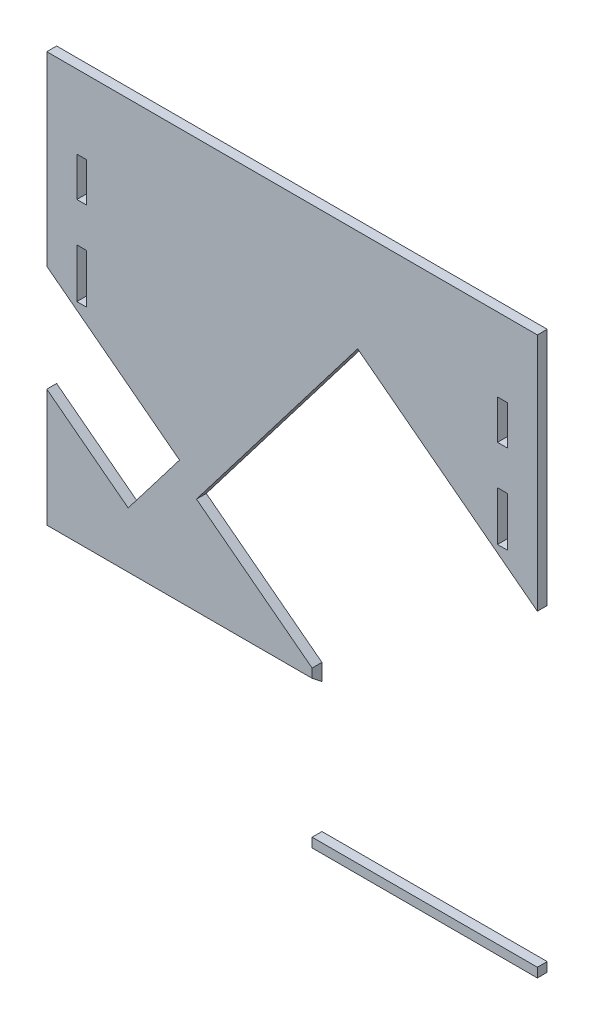
ISO-10303-21;
HEADER;
FILE_DESCRIPTION(('STEP AP214'),'2;1');
FILE_NAME('part.step','',(''),(''),'','','');
FILE_SCHEMA(('AUTOMOTIVE_DESIGN { 1 0 10303 214 1 1 1 1 }'));
ENDSEC;
DATA;
#1=APPLICATION_CONTEXT('core data for automotive mechanical design processes');
#2=APPLICATION_PROTOCOL_DEFINITION('international standard','automotive_design',2000,#1);
#3=PRODUCT_CONTEXT('',#1,'mechanical');
#4=PRODUCT('Part','Part','',(#3));
#5=PRODUCT_RELATED_PRODUCT_CATEGORY('part','',(#4));
#6=PRODUCT_DEFINITION_FORMATION('','',#4);
#7=PRODUCT_DEFINITION_CONTEXT('part definition',#1,'design');
#8=PRODUCT_DEFINITION('design','',#6,#7);
#9=PRODUCT_DEFINITION_SHAPE('','',#8);
#10=(LENGTH_UNIT() NAMED_UNIT(*) SI_UNIT(.MILLI.,.METRE.));
#11=(NAMED_UNIT(*) PLANE_ANGLE_UNIT() SI_UNIT($,.RADIAN.));
#12=(NAMED_UNIT(*) SI_UNIT($,.STERADIAN.) SOLID_ANGLE_UNIT());
#13=UNCERTAINTY_MEASURE_WITH_UNIT(LENGTH_MEASURE(1.E-05),#10,'distance_accuracy_value','');
#14=(GEOMETRIC_REPRESENTATION_CONTEXT(3) GLOBAL_UNCERTAINTY_ASSIGNED_CONTEXT((#13)) GLOBAL_UNIT_ASSIGNED_CONTEXT((#10,
#11,#12)) REPRESENTATION_CONTEXT('',''));
#15=CARTESIAN_POINT('',(0.,0.,0.));
#16=DIRECTION('',(0.,0.,1.));
#17=DIRECTION('',(1.,0.,0.));
#18=AXIS2_PLACEMENT_3D('',#15,#16,#17);
#19=CARTESIAN_POINT('',(0.,0.,5.));
#20=DIRECTION('',(1.,0.,0.));
#21=DIRECTION('',(0.,1.,0.));
#22=AXIS2_PLACEMENT_3D('',#19,#20,#21);
#23=PLANE('',#22);
#24=DIRECTION('',(0.,-1.,0.));
#25=VECTOR('',#24,1.);
#26=CARTESIAN_POINT('',(0.,0.,0.));
#27=LINE('',#26,#25);
#28=CARTESIAN_POINT('',(0.,0.,0.));
#29=VERTEX_POINT('',#28);
#30=CARTESIAN_POINT('',(0.,-94.5646580558317,0.));
#31=VERTEX_POINT('',#30);
#32=EDGE_CURVE('E402',#29,#31,#27,.T.);
#33=ORIENTED_EDGE('',*,*,#32,.T.);
#34=DIRECTION('',(0.,0.,1.));
#35=VECTOR('',#34,1.);
#36=CARTESIAN_POINT('',(0.,-94.5646580558317,0.));
#37=LINE('',#36,#35);
#38=CARTESIAN_POINT('',(0.,-94.5646580558317,5.));
#39=VERTEX_POINT('',#38);
#40=EDGE_CURVE('E380',#31,#39,#37,.T.);
#41=ORIENTED_EDGE('',*,*,#40,.T.);
#42=DIRECTION('',(0.,-1.,0.));
#43=VECTOR('',#42,1.);
#44=CARTESIAN_POINT('',(0.,0.,5.));
#45=LINE('',#44,#43);
#46=CARTESIAN_POINT('',(0.,0.,5.));
#47=VERTEX_POINT('',#46);
#48=EDGE_CURVE('E409',#47,#39,#45,.T.);
#49=ORIENTED_EDGE('',*,*,#48,.F.);
#50=DIRECTION('',(0.,0.,-1.));
#51=VECTOR('',#50,1.);
#52=CARTESIAN_POINT('',(0.,0.,5.));
#53=LINE('',#52,#51);
#54=EDGE_CURVE('E396',#47,#29,#53,.T.);
#55=ORIENTED_EDGE('',*,*,#54,.T.);
#56=EDGE_LOOP('',(#33,#41,#49,#55));
#57=FACE_BOUND('',#56,.T.);
#58=ADVANCED_FACE('F43',(#57),#23,.F.);
#59=CARTESIAN_POINT('',(249.6,0.,5.));
#60=DIRECTION('',(-1.,0.,0.));
#61=DIRECTION('',(0.,-1.,0.));
#62=AXIS2_PLACEMENT_3D('',#59,#60,#61);
#63=PLANE('',#62);
#64=DIRECTION('',(0.,1.,0.));
#65=VECTOR('',#64,1.);
#66=CARTESIAN_POINT('',(249.6,0.,5.));
#67=LINE('',#66,#65);
#68=CARTESIAN_POINT('',(249.6,-121.767183305226,5.));
#69=VERTEX_POINT('',#68);
#70=CARTESIAN_POINT('',(249.6,0.,5.));
#71=VERTEX_POINT('',#70);
#72=EDGE_CURVE('E408',#69,#71,#67,.T.);
#73=ORIENTED_EDGE('',*,*,#72,.F.);
#74=DIRECTION('',(0.,0.,1.));
#75=VECTOR('',#74,1.);
#76=CARTESIAN_POINT('',(249.6,-121.767183305226,0.));
#77=LINE('',#76,#75);
#78=CARTESIAN_POINT('',(249.6,-121.767183305226,0.));
#79=VERTEX_POINT('',#78);
#80=EDGE_CURVE('E51',#79,#69,#77,.T.);
#81=ORIENTED_EDGE('',*,*,#80,.F.);
#82=DIRECTION('',(0.,1.,0.));
#83=VECTOR('',#82,1.);
#84=CARTESIAN_POINT('',(249.6,0.,0.));
#85=LINE('',#84,#83);
#86=CARTESIAN_POINT('',(249.6,0.,0.));
#87=VERTEX_POINT('',#86);
#88=EDGE_CURVE('E383',#79,#87,#85,.T.);
#89=ORIENTED_EDGE('',*,*,#88,.T.);
#90=DIRECTION('',(0.,0.,-1.));
#91=VECTOR('',#90,1.);
#92=CARTESIAN_POINT('',(249.6,0.,5.));
#93=LINE('',#92,#91);
#94=EDGE_CURVE('E392',#71,#87,#93,.T.);
#95=ORIENTED_EDGE('',*,*,#94,.F.);
#96=EDGE_LOOP('',(#73,#81,#89,#95));
#97=FACE_BOUND('',#96,.T.);
#98=ADVANCED_FACE('F45',(#97),#63,.F.);
#99=CARTESIAN_POINT('',(0.,0.,5.));
#100=DIRECTION('',(0.,0.,1.));
#101=DIRECTION('',(1.,0.,0.));
#102=AXIS2_PLACEMENT_3D('',#99,#100,#101);
#103=PLANE('',#102);
#104=DIRECTION('',(0.,-1.,0.));
#105=VECTOR('',#104,1.);
#106=CARTESIAN_POINT('',(15.2881556161835,-77.4778714858661,5.));
#107=LINE('',#106,#105);
#108=CARTESIAN_POINT('',(15.2881556161835,-77.4778714858661,5.));
#109=VERTEX_POINT('',#108);
#110=CARTESIAN_POINT('',(15.2881556161835,-102.477871485866,5.));
#111=VERTEX_POINT('',#110);
#112=EDGE_CURVE('E58',#109,#111,#107,.T.);
#113=ORIENTED_EDGE('',*,*,#112,.F.);
#114=DIRECTION('',(-1.,0.,0.));
#115=VECTOR('',#114,1.);
#116=CARTESIAN_POINT('',(15.2881556161835,-77.4778714858661,5.));
#117=LINE('',#116,#115);
#118=CARTESIAN_POINT('',(20.2881556161835,-77.4778714858661,5.));
#119=VERTEX_POINT('',#118);
#120=EDGE_CURVE('E307',#119,#109,#117,.T.);
#121=ORIENTED_EDGE('',*,*,#120,.F.);
#122=DIRECTION('',(0.,1.,0.));
#123=VECTOR('',#122,1.);
#124=CARTESIAN_POINT('',(20.2881556161835,-77.4778714858661,5.));
#125=LINE('',#124,#123);
#126=CARTESIAN_POINT('',(20.2881556161835,-102.477871485866,5.));
#127=VERTEX_POINT('',#126);
#128=EDGE_CURVE('E321',#127,#119,#125,.T.);
#129=ORIENTED_EDGE('',*,*,#128,.F.);
#130=DIRECTION('',(1.,0.,0.));
#131=VECTOR('',#130,1.);
#132=CARTESIAN_POINT('',(15.2881556161835,-102.477871485866,5.));
#133=LINE('',#132,#131);
#134=EDGE_CURVE('E318',#111,#127,#133,.T.);
#135=ORIENTED_EDGE('',*,*,#134,.F.);
#136=EDGE_LOOP('',(#113,#121,#129,#135));
#137=FACE_BOUND('',#136,.T.);
#138=DIRECTION('',(0.,-1.,0.));
#139=VECTOR('',#138,1.);
#140=CARTESIAN_POINT('',(229.311844383817,-77.4778714858661,5.));
#141=LINE('',#140,#139);
#142=CARTESIAN_POINT('',(229.311844383817,-77.4778714858661,5.));
#143=VERTEX_POINT('',#142);
#144=CARTESIAN_POINT('',(229.311844383817,-102.477871485866,5.));
#145=VERTEX_POINT('',#144);
#146=EDGE_CURVE('E66',#143,#145,#141,.T.);
#147=ORIENTED_EDGE('',*,*,#146,.F.);
#148=DIRECTION('',(-1.,0.,0.));
#149=VECTOR('',#148,1.);
#150=CARTESIAN_POINT('',(229.311844383817,-77.4778714858661,5.));
#151=LINE('',#150,#149);
#152=CARTESIAN_POINT('',(234.311844383817,-77.4778714858661,5.));
#153=VERTEX_POINT('',#152);
#154=EDGE_CURVE('E277',#153,#143,#151,.T.);
#155=ORIENTED_EDGE('',*,*,#154,.F.);
#156=DIRECTION('',(0.,1.,0.));
#157=VECTOR('',#156,1.);
#158=CARTESIAN_POINT('',(234.311844383817,-77.4778714858661,5.));
#159=LINE('',#158,#157);
#160=CARTESIAN_POINT('',(234.311844383817,-102.477871485866,5.));
#161=VERTEX_POINT('',#160);
#162=EDGE_CURVE('E292',#161,#153,#159,.T.);
#163=ORIENTED_EDGE('',*,*,#162,.F.);
#164=DIRECTION('',(1.,0.,0.));
#165=VECTOR('',#164,1.);
#166=CARTESIAN_POINT('',(229.311844383817,-102.477871485866,5.));
#167=LINE('',#166,#165);
#168=EDGE_CURVE('E288',#145,#161,#167,.T.);
#169=ORIENTED_EDGE('',*,*,#168,.F.);
#170=EDGE_LOOP('',(#147,#155,#163,#169));
#171=FACE_BOUND('',#170,.T.);
#172=DIRECTION('',(0.,-1.,0.));
#173=VECTOR('',#172,1.);
#174=CARTESIAN_POINT('',(229.311844383817,-37.4778714858661,5.));
#175=LINE('',#174,#173);
#176=CARTESIAN_POINT('',(229.311844383817,-37.4778714858661,5.));
#177=VERTEX_POINT('',#176);
#178=CARTESIAN_POINT('',(229.311844383817,-57.4778714858661,5.));
#179=VERTEX_POINT('',#178);
#180=EDGE_CURVE('E235',#177,#179,#175,.T.);
#181=ORIENTED_EDGE('',*,*,#180,.F.);
#182=DIRECTION('',(-1.,0.,0.));
#183=VECTOR('',#182,1.);
#184=CARTESIAN_POINT('',(229.311844383817,-37.4778714858661,5.));
#185=LINE('',#184,#183);
#186=CARTESIAN_POINT('',(234.311844383817,-37.4778714858661,5.));
#187=VERTEX_POINT('',#186);
#188=EDGE_CURVE('E253',#187,#177,#185,.T.);
#189=ORIENTED_EDGE('',*,*,#188,.F.);
#190=DIRECTION('',(0.,1.,0.));
#191=VECTOR('',#190,1.);
#192=CARTESIAN_POINT('',(234.311844383817,-37.4778714858661,5.));
#193=LINE('',#192,#191);
#194=CARTESIAN_POINT('',(234.311844383817,-57.4778714858661,5.));
#195=VERTEX_POINT('',#194);
#196=EDGE_CURVE('E256',#195,#187,#193,.T.);
#197=ORIENTED_EDGE('',*,*,#196,.F.);
#198=DIRECTION('',(1.,0.,0.));
#199=VECTOR('',#198,1.);
#200=CARTESIAN_POINT('',(229.311844383817,-57.4778714858661,5.));
#201=LINE('',#200,#199);
#202=EDGE_CURVE('E262',#179,#195,#201,.T.);
#203=ORIENTED_EDGE('',*,*,#202,.F.);
#204=EDGE_LOOP('',(#181,#189,#197,#203));
#205=FACE_BOUND('',#204,.T.);
#206=DIRECTION('',(0.,-1.,0.));
#207=VECTOR('',#206,1.);
#208=CARTESIAN_POINT('',(15.2881556161835,-37.4778714858661,5.));
#209=LINE('',#208,#207);
#210=CARTESIAN_POINT('',(15.2881556161835,-37.4778714858661,5.));
#211=VERTEX_POINT('',#210);
#212=CARTESIAN_POINT('',(15.2881556161835,-57.4778714858661,5.));
#213=VERTEX_POINT('',#212);
#214=EDGE_CURVE('E269',#211,#213,#209,.T.);
#215=ORIENTED_EDGE('',*,*,#214,.F.);
#216=DIRECTION('',(-1.,0.,0.));
#217=VECTOR('',#216,1.);
#218=CARTESIAN_POINT('',(15.2881556161835,-37.4778714858661,5.));
#219=LINE('',#218,#217);
#220=CARTESIAN_POINT('',(20.2881556161835,-37.4778714858661,5.));
#221=VERTEX_POINT('',#220);
#222=EDGE_CURVE('E336',#221,#211,#219,.T.);
#223=ORIENTED_EDGE('',*,*,#222,.F.);
#224=DIRECTION('',(0.,1.,0.));
#225=VECTOR('',#224,1.);
#226=CARTESIAN_POINT('',(20.2881556161835,-37.4778714858661,5.));
#227=LINE('',#226,#225);
#228=CARTESIAN_POINT('',(20.2881556161835,-57.4778714858661,5.));
#229=VERTEX_POINT('',#228);
#230=EDGE_CURVE('E350',#229,#221,#227,.T.);
#231=ORIENTED_EDGE('',*,*,#230,.F.);
#232=DIRECTION('',(1.,0.,0.));
#233=VECTOR('',#232,1.);
#234=CARTESIAN_POINT('',(15.2881556161835,-57.4778714858661,5.));
#235=LINE('',#234,#233);
#236=EDGE_CURVE('E347',#213,#229,#235,.T.);
#237=ORIENTED_EDGE('',*,*,#236,.F.);
#238=EDGE_LOOP('',(#215,#223,#231,#237));
#239=FACE_BOUND('',#238,.T.);
#240=DIRECTION('',(-0.794388962001185,0.607409398223867,0.));
#241=VECTOR('',#240,1.);
#242=CARTESIAN_POINT('',(0.,-94.5646580558317,5.));
#243=LINE('',#242,#241);
#244=CARTESIAN_POINT('',(67.5230617701007,-146.19445690486,5.));
#245=VERTEX_POINT('',#244);
#246=EDGE_CURVE('E368',#245,#39,#243,.T.);
#247=ORIENTED_EDGE('',*,*,#246,.F.);
#248=DIRECTION('',(0.607409398223867,0.794388962001185,0.));
#249=VECTOR('',#248,1.);
#250=CARTESIAN_POINT('',(67.5230617701007,-146.19445690486,5.));
#251=LINE('',#250,#249);
#252=CARTESIAN_POINT('',(41.4044576464744,-180.353182270911,5.));
#253=VERTEX_POINT('',#252);
#254=EDGE_CURVE('E376',#253,#245,#251,.T.);
#255=ORIENTED_EDGE('',*,*,#254,.F.);
#256=DIRECTION('',(0.794388962001185,-0.607409398223867,0.));
#257=VECTOR('',#256,1.);
#258=CARTESIAN_POINT('',(-26.1186041236263,-128.723383421883,5.));
#259=LINE('',#258,#257);
#260=CARTESIAN_POINT('',(0.,-148.694312490703,5.));
#261=VERTEX_POINT('',#260);
#262=EDGE_CURVE('E357',#261,#253,#259,.T.);
#263=ORIENTED_EDGE('',*,*,#262,.F.);
#264=CARTESIAN_POINT('',(1.32380998121945E-13,-208.618578951241,4.99999999999998));
#265=VERTEX_POINT('',#264);
#266=EDGE_CURVE('E407',#261,#265,#45,.T.);
#267=ORIENTED_EDGE('',*,*,#266,.T.);
#268=DIRECTION('',(1.,0.,0.));
#269=VECTOR('',#268,1.);
#270=CARTESIAN_POINT('',(0.,-208.618578951241,5.));
#271=LINE('',#270,#269);
#272=CARTESIAN_POINT('',(135.000000000001,-208.618578951241,4.99999999999998));
#273=VERTEX_POINT('',#272);
#274=EDGE_CURVE('E412',#265,#273,#271,.T.);
#275=ORIENTED_EDGE('',*,*,#274,.T.);
#276=DIRECTION('',(0.,-1.,0.));
#277=VECTOR('',#276,1.);
#278=CARTESIAN_POINT('',(135.000000000001,-204.083134421686,5.));
#279=LINE('',#278,#277);
#280=CARTESIAN_POINT('',(135.000000000001,-204.083134421686,5.));
#281=VERTEX_POINT('',#280);
#282=EDGE_CURVE('E430',#281,#273,#279,.T.);
#283=ORIENTED_EDGE('',*,*,#282,.F.);
#284=DIRECTION('',(0.794388962001186,-0.607409398223866,0.));
#285=VECTOR('',#284,1.);
#286=CARTESIAN_POINT('',(135.000000000001,-204.083134421686,5.));
#287=LINE('',#286,#285);
#288=CARTESIAN_POINT('',(76.149175744963,-159.084342324072,5.));
#289=VERTEX_POINT('',#288);
#290=EDGE_CURVE('E428',#289,#281,#287,.T.);
#291=ORIENTED_EDGE('',*,*,#290,.F.);
#292=DIRECTION('',(-0.607409398223868,-0.794388962001184,0.));
#293=VECTOR('',#292,1.);
#294=CARTESIAN_POINT('',(76.149175744963,-159.084342324072,5.));
#295=LINE('',#294,#293);
#296=CARTESIAN_POINT('',(158.149444505186,-51.841832453912,5.));
#297=VERTEX_POINT('',#296);
#298=EDGE_CURVE('E425',#297,#289,#295,.T.);
#299=ORIENTED_EDGE('',*,*,#298,.F.);
#300=DIRECTION('',(-0.794388962001203,0.607409398223843,0.));
#301=VECTOR('',#300,1.);
#302=CARTESIAN_POINT('',(158.149444505186,-51.841832453912,5.));
#303=LINE('',#302,#301);
#304=EDGE_CURVE('E422',#69,#297,#303,.T.);
#305=ORIENTED_EDGE('',*,*,#304,.F.);
#306=ORIENTED_EDGE('',*,*,#72,.T.);
#307=DIRECTION('',(-1.,0.,0.));
#308=VECTOR('',#307,1.);
#309=CARTESIAN_POINT('',(0.,0.,5.));
#310=LINE('',#309,#308);
#311=EDGE_CURVE('E405',#71,#47,#310,.T.);
#312=ORIENTED_EDGE('',*,*,#311,.T.);
#313=ORIENTED_EDGE('',*,*,#48,.T.);
#314=EDGE_LOOP('',(#247,#255,#263,#267,#275,#283,#291,#299,#305,#306,#312,#313));
#315=FACE_BOUND('',#314,.T.);
#316=ADVANCED_FACE('F465',(#137,#171,#205,#239,#315),#103,.T.);
#317=CARTESIAN_POINT('',(0.,0.,0.));
#318=DIRECTION('',(0.,0.,1.));
#319=DIRECTION('',(1.,0.,0.));
#320=AXIS2_PLACEMENT_3D('',#317,#318,#319);
#321=PLANE('',#320);
#322=DIRECTION('',(-1.,0.,0.));
#323=VECTOR('',#322,1.);
#324=CARTESIAN_POINT('',(15.2881556161835,-77.4778714858661,0.));
#325=LINE('',#324,#323);
#326=CARTESIAN_POINT('',(20.2881556161835,-77.4778714858661,0.));
#327=VERTEX_POINT('',#326);
#328=CARTESIAN_POINT('',(15.2881556161835,-77.4778714858661,0.));
#329=VERTEX_POINT('',#328);
#330=EDGE_CURVE('E313',#327,#329,#325,.T.);
#331=ORIENTED_EDGE('',*,*,#330,.T.);
#332=DIRECTION('',(0.,-1.,0.));
#333=VECTOR('',#332,1.);
#334=CARTESIAN_POINT('',(15.2881556161835,-77.4778714858661,0.));
#335=LINE('',#334,#333);
#336=CARTESIAN_POINT('',(15.2881556161835,-102.477871485866,0.));
#337=VERTEX_POINT('',#336);
#338=EDGE_CURVE('E303',#329,#337,#335,.T.);
#339=ORIENTED_EDGE('',*,*,#338,.T.);
#340=DIRECTION('',(1.,0.,0.));
#341=VECTOR('',#340,1.);
#342=CARTESIAN_POINT('',(15.2881556161835,-102.477871485866,0.));
#343=LINE('',#342,#341);
#344=CARTESIAN_POINT('',(20.2881556161835,-102.477871485866,0.));
#345=VERTEX_POINT('',#344);
#346=EDGE_CURVE('E306',#337,#345,#343,.T.);
#347=ORIENTED_EDGE('',*,*,#346,.T.);
#348=DIRECTION('',(0.,1.,0.));
#349=VECTOR('',#348,1.);
#350=CARTESIAN_POINT('',(20.2881556161835,-77.4778714858661,0.));
#351=LINE('',#350,#349);
#352=EDGE_CURVE('E310',#345,#327,#351,.T.);
#353=ORIENTED_EDGE('',*,*,#352,.T.);
#354=EDGE_LOOP('',(#331,#339,#347,#353));
#355=FACE_BOUND('',#354,.T.);
#356=DIRECTION('',(-1.,0.,0.));
#357=VECTOR('',#356,1.);
#358=CARTESIAN_POINT('',(229.311844383817,-77.4778714858661,0.));
#359=LINE('',#358,#357);
#360=CARTESIAN_POINT('',(234.311844383817,-77.4778714858661,0.));
#361=VERTEX_POINT('',#360);
#362=CARTESIAN_POINT('',(229.311844383817,-77.4778714858661,0.));
#363=VERTEX_POINT('',#362);
#364=EDGE_CURVE('E283',#361,#363,#359,.T.);
#365=ORIENTED_EDGE('',*,*,#364,.T.);
#366=DIRECTION('',(0.,-1.,0.));
#367=VECTOR('',#366,1.);
#368=CARTESIAN_POINT('',(229.311844383817,-77.4778714858661,0.));
#369=LINE('',#368,#367);
#370=CARTESIAN_POINT('',(229.311844383817,-102.477871485866,0.));
#371=VERTEX_POINT('',#370);
#372=EDGE_CURVE('E273',#363,#371,#369,.T.);
#373=ORIENTED_EDGE('',*,*,#372,.T.);
#374=DIRECTION('',(1.,0.,0.));
#375=VECTOR('',#374,1.);
#376=CARTESIAN_POINT('',(229.311844383817,-102.477871485866,0.));
#377=LINE('',#376,#375);
#378=CARTESIAN_POINT('',(234.311844383817,-102.477871485866,0.));
#379=VERTEX_POINT('',#378);
#380=EDGE_CURVE('E276',#371,#379,#377,.T.);
#381=ORIENTED_EDGE('',*,*,#380,.T.);
#382=DIRECTION('',(0.,1.,0.));
#383=VECTOR('',#382,1.);
#384=CARTESIAN_POINT('',(234.311844383817,-77.4778714858661,0.));
#385=LINE('',#384,#383);
#386=EDGE_CURVE('E280',#379,#361,#385,.T.);
#387=ORIENTED_EDGE('',*,*,#386,.T.);
#388=EDGE_LOOP('',(#365,#373,#381,#387));
#389=FACE_BOUND('',#388,.T.);
#390=DIRECTION('',(-1.,0.,0.));
#391=VECTOR('',#390,1.);
#392=CARTESIAN_POINT('',(229.311844383817,-37.4778714858661,0.));
#393=LINE('',#392,#391);
#394=CARTESIAN_POINT('',(234.311844383817,-37.4778714858661,0.));
#395=VERTEX_POINT('',#394);
#396=CARTESIAN_POINT('',(229.311844383817,-37.4778714858661,0.));
#397=VERTEX_POINT('',#396);
#398=EDGE_CURVE('E240',#395,#397,#393,.T.);
#399=ORIENTED_EDGE('',*,*,#398,.T.);
#400=DIRECTION('',(0.,-1.,0.));
#401=VECTOR('',#400,1.);
#402=CARTESIAN_POINT('',(229.311844383817,-37.4778714858661,0.));
#403=LINE('',#402,#401);
#404=CARTESIAN_POINT('',(229.311844383817,-57.4778714858661,0.));
#405=VERTEX_POINT('',#404);
#406=EDGE_CURVE('E232',#397,#405,#403,.T.);
#407=ORIENTED_EDGE('',*,*,#406,.T.);
#408=DIRECTION('',(1.,0.,0.));
#409=VECTOR('',#408,1.);
#410=CARTESIAN_POINT('',(229.311844383817,-57.4778714858661,0.));
#411=LINE('',#410,#409);
#412=CARTESIAN_POINT('',(234.311844383817,-57.4778714858661,0.));
#413=VERTEX_POINT('',#412);
#414=EDGE_CURVE('E244',#405,#413,#411,.T.);
#415=ORIENTED_EDGE('',*,*,#414,.T.);
#416=DIRECTION('',(0.,1.,0.));
#417=VECTOR('',#416,1.);
#418=CARTESIAN_POINT('',(234.311844383817,-37.4778714858661,0.));
#419=LINE('',#418,#417);
#420=EDGE_CURVE('E248',#413,#395,#419,.T.);
#421=ORIENTED_EDGE('',*,*,#420,.T.);
#422=EDGE_LOOP('',(#399,#407,#415,#421));
#423=FACE_BOUND('',#422,.T.);
#424=DIRECTION('',(-1.,0.,0.));
#425=VECTOR('',#424,1.);
#426=CARTESIAN_POINT('',(15.2881556161835,-37.4778714858661,0.));
#427=LINE('',#426,#425);
#428=CARTESIAN_POINT('',(20.2881556161835,-37.4778714858661,0.));
#429=VERTEX_POINT('',#428);
#430=CARTESIAN_POINT('',(15.2881556161835,-37.4778714858661,0.));
#431=VERTEX_POINT('',#430);
#432=EDGE_CURVE('E342',#429,#431,#427,.T.);
#433=ORIENTED_EDGE('',*,*,#432,.T.);
#434=DIRECTION('',(0.,-1.,0.));
#435=VECTOR('',#434,1.);
#436=CARTESIAN_POINT('',(15.2881556161835,-37.4778714858661,0.));
#437=LINE('',#436,#435);
#438=CARTESIAN_POINT('',(15.2881556161835,-57.4778714858661,0.));
#439=VERTEX_POINT('',#438);
#440=EDGE_CURVE('E332',#431,#439,#437,.T.);
#441=ORIENTED_EDGE('',*,*,#440,.T.);
#442=DIRECTION('',(1.,0.,0.));
#443=VECTOR('',#442,1.);
#444=CARTESIAN_POINT('',(15.2881556161835,-57.4778714858661,0.));
#445=LINE('',#444,#443);
#446=CARTESIAN_POINT('',(20.2881556161835,-57.4778714858661,0.));
#447=VERTEX_POINT('',#446);
#448=EDGE_CURVE('E335',#439,#447,#445,.T.);
#449=ORIENTED_EDGE('',*,*,#448,.T.);
#450=DIRECTION('',(0.,1.,0.));
#451=VECTOR('',#450,1.);
#452=CARTESIAN_POINT('',(20.2881556161835,-37.4778714858661,0.));
#453=LINE('',#452,#451);
#454=EDGE_CURVE('E339',#447,#429,#453,.T.);
#455=ORIENTED_EDGE('',*,*,#454,.T.);
#456=EDGE_LOOP('',(#433,#441,#449,#455));
#457=FACE_BOUND('',#456,.T.);
#458=DIRECTION('',(0.607409398223867,0.794388962001185,0.));
#459=VECTOR('',#458,1.);
#460=CARTESIAN_POINT('',(67.5230617701007,-146.19445690486,0.));
#461=LINE('',#460,#459);
#462=CARTESIAN_POINT('',(41.4044576464744,-180.353182270911,0.));
#463=VERTEX_POINT('',#462);
#464=CARTESIAN_POINT('',(67.5230617701007,-146.19445690486,0.));
#465=VERTEX_POINT('',#464);
#466=EDGE_CURVE('E367',#463,#465,#461,.T.);
#467=ORIENTED_EDGE('',*,*,#466,.T.);
#468=DIRECTION('',(-0.794388962001185,0.607409398223867,0.));
#469=VECTOR('',#468,1.);
#470=CARTESIAN_POINT('',(0.,-94.5646580558317,0.));
#471=LINE('',#470,#469);
#472=EDGE_CURVE('E371',#465,#31,#471,.T.);
#473=ORIENTED_EDGE('',*,*,#472,.T.);
#474=ORIENTED_EDGE('',*,*,#32,.F.);
#475=DIRECTION('',(-1.,0.,0.));
#476=VECTOR('',#475,1.);
#477=CARTESIAN_POINT('',(0.,0.,0.));
#478=LINE('',#477,#476);
#479=EDGE_CURVE('E395',#87,#29,#478,.T.);
#480=ORIENTED_EDGE('',*,*,#479,.F.);
#481=ORIENTED_EDGE('',*,*,#88,.F.);
#482=DIRECTION('',(-0.794388962001154,0.607409398223908,0.));
#483=VECTOR('',#482,1.);
#484=CARTESIAN_POINT('',(214.957001473172,-95.2782919756631,0.));
#485=LINE('',#484,#483);
#486=CARTESIAN_POINT('',(158.149444505186,-51.841832453912,0.));
#487=VERTEX_POINT('',#486);
#488=EDGE_CURVE('E443',#79,#487,#485,.T.);
#489=ORIENTED_EDGE('',*,*,#488,.T.);
#490=DIRECTION('',(-0.607409398223868,-0.794388962001184,0.));
#491=VECTOR('',#490,1.);
#492=CARTESIAN_POINT('',(76.149175744963,-159.084342324072,0.));
#493=LINE('',#492,#491);
#494=CARTESIAN_POINT('',(76.149175744963,-159.084342324072,0.));
#495=VERTEX_POINT('',#494);
#496=EDGE_CURVE('E418',#487,#495,#493,.T.);
#497=ORIENTED_EDGE('',*,*,#496,.T.);
#498=DIRECTION('',(0.794388962001186,-0.607409398223866,0.));
#499=VECTOR('',#498,1.);
#500=CARTESIAN_POINT('',(135.000000000001,-204.083134421686,0.));
#501=LINE('',#500,#499);
#502=CARTESIAN_POINT('',(135.000000000001,-204.083134421686,0.));
#503=VERTEX_POINT('',#502);
#504=EDGE_CURVE('E415',#495,#503,#501,.T.);
#505=ORIENTED_EDGE('',*,*,#504,.T.);
#506=DIRECTION('',(0.,-1.,0.));
#507=VECTOR('',#506,1.);
#508=CARTESIAN_POINT('',(135.000000000001,-204.083134421686,0.));
#509=LINE('',#508,#507);
#510=CARTESIAN_POINT('',(135.000000000001,-212.525007083775,0.));
#511=VERTEX_POINT('',#510);
#512=EDGE_CURVE('E440',#503,#511,#509,.T.);
#513=ORIENTED_EDGE('',*,*,#512,.T.);
#514=DIRECTION('',(1.,0.,0.));
#515=VECTOR('',#514,1.);
#516=CARTESIAN_POINT('',(0.,-212.525007083775,0.));
#517=LINE('',#516,#515);
#518=CARTESIAN_POINT('',(0.,-212.525007083775,0.));
#519=VERTEX_POINT('',#518);
#520=EDGE_CURVE('E388',#519,#511,#517,.T.);
#521=ORIENTED_EDGE('',*,*,#520,.F.);
#522=CARTESIAN_POINT('',(0.,-148.694312490703,0.));
#523=VERTEX_POINT('',#522);
#524=EDGE_CURVE('E399',#523,#519,#27,.T.);
#525=ORIENTED_EDGE('',*,*,#524,.F.);
#526=DIRECTION('',(0.794388962001185,-0.607409398223867,0.));
#527=VECTOR('',#526,1.);
#528=CARTESIAN_POINT('',(-26.1186041236263,-128.723383421883,0.));
#529=LINE('',#528,#527);
#530=EDGE_CURVE('E364',#523,#463,#529,.T.);
#531=ORIENTED_EDGE('',*,*,#530,.T.);
#532=EDGE_LOOP('',(#467,#473,#474,#480,#481,#489,#497,#505,#513,#521,#525,#531));
#533=FACE_BOUND('',#532,.T.);
#534=ADVANCED_FACE('F250',(#355,#389,#423,#457,#533),#321,.F.);
#535=ORIENTED_EDGE('',*,*,#266,.F.);
#536=DIRECTION('',(0.,0.,-1.));
#537=VECTOR('',#536,1.);
#538=CARTESIAN_POINT('',(0.,-148.694312490703,5.));
#539=LINE('',#538,#537);
#540=EDGE_CURVE('E12',#261,#523,#539,.T.);
#541=ORIENTED_EDGE('',*,*,#540,.T.);
#542=ORIENTED_EDGE('',*,*,#524,.T.);
#543=DIRECTION('',(0.,0.61566147532566,0.788010753606721));
#544=VECTOR('',#543,1.);
#545=CARTESIAN_POINT('',(1.21955812873337E-13,-266.558641082654,-69.1598976938488));
#546=LINE('',#545,#544);
#547=EDGE_CURVE('E400',#519,#265,#546,.T.);
#548=ORIENTED_EDGE('',*,*,#547,.T.);
#549=EDGE_LOOP('',(#535,#541,#542,#548));
#550=FACE_BOUND('',#549,.T.);
#551=ADVANCED_FACE('F491',(#550),#23,.F.);
#552=CARTESIAN_POINT('',(0.,0.,5.));
#553=DIRECTION('',(0.,-1.,0.));
#554=DIRECTION('',(1.,0.,0.));
#555=AXIS2_PLACEMENT_3D('',#552,#553,#554);
#556=PLANE('',#555);
#557=ORIENTED_EDGE('',*,*,#479,.T.);
#558=ORIENTED_EDGE('',*,*,#54,.F.);
#559=ORIENTED_EDGE('',*,*,#311,.F.);
#560=ORIENTED_EDGE('',*,*,#94,.T.);
#561=EDGE_LOOP('',(#557,#558,#559,#560));
#562=FACE_BOUND('',#561,.T.);
#563=ADVANCED_FACE('F457',(#562),#556,.F.);
#564=CARTESIAN_POINT('',(0.,-131.969729829907,103.106053050081));
#565=DIRECTION('',(0.,-0.788010753606721,0.61566147532566));
#566=DIRECTION('',(0.,-0.61566147532566,-0.788010753606721));
#567=AXIS2_PLACEMENT_3D('',#564,#565,#566);
#568=PLANE('',#567);
#569=ORIENTED_EDGE('',*,*,#547,.F.);
#570=ORIENTED_EDGE('',*,*,#520,.T.);
#571=DIRECTION('',(0.,-0.61566147532566,-0.788010753606721));
#572=VECTOR('',#571,1.);
#573=CARTESIAN_POINT('',(135.000000000001,-266.558641082654,-69.1598976938488));
#574=LINE('',#573,#572);
#575=EDGE_CURVE('E391',#273,#511,#574,.T.);
#576=ORIENTED_EDGE('',*,*,#575,.F.);
#577=ORIENTED_EDGE('',*,*,#274,.F.);
#578=EDGE_LOOP('',(#569,#570,#576,#577));
#579=FACE_BOUND('',#578,.T.);
#580=ADVANCED_FACE('F487',(#579),#568,.T.);
#581=CARTESIAN_POINT('',(135.000000000001,-204.083134421686,0.));
#582=DIRECTION('',(-1.,0.,0.));
#583=DIRECTION('',(0.,0.,1.));
#584=AXIS2_PLACEMENT_3D('',#581,#582,#583);
#585=PLANE('',#584);
#586=ORIENTED_EDGE('',*,*,#575,.T.);
#587=ORIENTED_EDGE('',*,*,#512,.F.);
#588=DIRECTION('',(0.,0.,1.));
#589=VECTOR('',#588,1.);
#590=CARTESIAN_POINT('',(135.000000000001,-204.083134421686,0.));
#591=LINE('',#590,#589);
#592=EDGE_CURVE('E420',#503,#281,#591,.T.);
#593=ORIENTED_EDGE('',*,*,#592,.T.);
#594=ORIENTED_EDGE('',*,*,#282,.T.);
#595=EDGE_LOOP('',(#586,#587,#593,#594));
#596=FACE_BOUND('',#595,.T.);
#597=ADVANCED_FACE('F481',(#596),#585,.F.);
#598=CARTESIAN_POINT('',(135.000000000001,-204.083134421686,0.));
#599=DIRECTION('',(-0.607409398223866,-0.794388962001186,0.));
#600=DIRECTION('',(0.794388962001186,-0.607409398223866,0.));
#601=AXIS2_PLACEMENT_3D('',#598,#599,#600);
#602=PLANE('',#601);
#603=ORIENTED_EDGE('',*,*,#290,.T.);
#604=ORIENTED_EDGE('',*,*,#592,.F.);
#605=ORIENTED_EDGE('',*,*,#504,.F.);
#606=DIRECTION('',(0.,0.,1.));
#607=VECTOR('',#606,1.);
#608=CARTESIAN_POINT('',(76.149175744963,-159.084342324072,0.));
#609=LINE('',#608,#607);
#610=EDGE_CURVE('E426',#495,#289,#609,.T.);
#611=ORIENTED_EDGE('',*,*,#610,.T.);
#612=EDGE_LOOP('',(#603,#604,#605,#611));
#613=FACE_BOUND('',#612,.T.);
#614=ADVANCED_FACE('F477',(#613),#602,.F.);
#615=CARTESIAN_POINT('',(76.149175744963,-159.084342324072,0.));
#616=DIRECTION('',(-0.794388962001184,0.607409398223868,0.));
#617=DIRECTION('',(-0.607409398223868,-0.794388962001184,0.));
#618=AXIS2_PLACEMENT_3D('',#615,#616,#617);
#619=PLANE('',#618);
#620=ORIENTED_EDGE('',*,*,#298,.T.);
#621=ORIENTED_EDGE('',*,*,#610,.F.);
#622=ORIENTED_EDGE('',*,*,#496,.F.);
#623=DIRECTION('',(0.,0.,1.));
#624=VECTOR('',#623,1.);
#625=CARTESIAN_POINT('',(158.149444505186,-51.841832453912,0.));
#626=LINE('',#625,#624);
#627=EDGE_CURVE('E423',#487,#297,#626,.T.);
#628=ORIENTED_EDGE('',*,*,#627,.T.);
#629=EDGE_LOOP('',(#620,#621,#622,#628));
#630=FACE_BOUND('',#629,.T.);
#631=ADVANCED_FACE('F475',(#630),#619,.F.);
#632=CARTESIAN_POINT('',(158.149444505186,-51.841832453912,0.));
#633=DIRECTION('',(0.607409398223843,0.794388962001203,0.));
#634=DIRECTION('',(-0.794388962001203,0.607409398223843,0.));
#635=AXIS2_PLACEMENT_3D('',#632,#633,#634);
#636=PLANE('',#635);
#637=ORIENTED_EDGE('',*,*,#304,.T.);
#638=ORIENTED_EDGE('',*,*,#627,.F.);
#639=ORIENTED_EDGE('',*,*,#488,.F.);
#640=ORIENTED_EDGE('',*,*,#80,.T.);
#641=EDGE_LOOP('',(#637,#638,#639,#640));
#642=FACE_BOUND('',#641,.T.);
#643=ADVANCED_FACE('F471',(#642),#636,.F.);
#644=CARTESIAN_POINT('',(-26.1186041236263,-128.723383421883,0.));
#645=DIRECTION('',(-0.607409398223867,-0.794388962001185,0.));
#646=DIRECTION('',(0.794388962001185,-0.607409398223867,0.));
#647=AXIS2_PLACEMENT_3D('',#644,#645,#646);
#648=PLANE('',#647);
#649=ORIENTED_EDGE('',*,*,#262,.T.);
#650=DIRECTION('',(0.,0.,1.));
#651=VECTOR('',#650,1.);
#652=CARTESIAN_POINT('',(41.4044576464744,-180.353182270911,0.));
#653=LINE('',#652,#651);
#654=EDGE_CURVE('E374',#463,#253,#653,.T.);
#655=ORIENTED_EDGE('',*,*,#654,.F.);
#656=ORIENTED_EDGE('',*,*,#530,.F.);
#657=ORIENTED_EDGE('',*,*,#540,.F.);
#658=EDGE_LOOP('',(#649,#655,#656,#657));
#659=FACE_BOUND('',#658,.T.);
#660=ADVANCED_FACE('F494',(#659),#648,.F.);
#661=CARTESIAN_POINT('',(0.,-94.5646580558317,0.));
#662=DIRECTION('',(0.607409398223867,0.794388962001185,0.));
#663=DIRECTION('',(-0.794388962001185,0.607409398223867,0.));
#664=AXIS2_PLACEMENT_3D('',#661,#662,#663);
#665=PLANE('',#664);
#666=ORIENTED_EDGE('',*,*,#246,.T.);
#667=ORIENTED_EDGE('',*,*,#40,.F.);
#668=ORIENTED_EDGE('',*,*,#472,.F.);
#669=DIRECTION('',(0.,0.,1.));
#670=VECTOR('',#669,1.);
#671=CARTESIAN_POINT('',(67.5230617701007,-146.19445690486,0.));
#672=LINE('',#671,#670);
#673=EDGE_CURVE('E384',#465,#245,#672,.T.);
#674=ORIENTED_EDGE('',*,*,#673,.T.);
#675=EDGE_LOOP('',(#666,#667,#668,#674));
#676=FACE_BOUND('',#675,.T.);
#677=ADVANCED_FACE('F499',(#676),#665,.F.);
#678=CARTESIAN_POINT('',(67.5230617701007,-146.19445690486,0.));
#679=DIRECTION('',(0.794388962001185,-0.607409398223867,0.));
#680=DIRECTION('',(0.607409398223867,0.794388962001185,0.));
#681=AXIS2_PLACEMENT_3D('',#678,#679,#680);
#682=PLANE('',#681);
#683=ORIENTED_EDGE('',*,*,#254,.T.);
#684=ORIENTED_EDGE('',*,*,#673,.F.);
#685=ORIENTED_EDGE('',*,*,#466,.F.);
#686=ORIENTED_EDGE('',*,*,#654,.T.);
#687=EDGE_LOOP('',(#683,#684,#685,#686));
#688=FACE_BOUND('',#687,.T.);
#689=ADVANCED_FACE('F497',(#688),#682,.F.);
#690=CARTESIAN_POINT('',(15.2881556161835,-37.4778714858661,0.));
#691=DIRECTION('',(-1.,0.,0.));
#692=DIRECTION('',(0.,-1.,0.));
#693=AXIS2_PLACEMENT_3D('',#690,#691,#692);
#694=PLANE('',#693);
#695=ORIENTED_EDGE('',*,*,#214,.T.);
#696=DIRECTION('',(0.,0.,1.));
#697=VECTOR('',#696,1.);
#698=CARTESIAN_POINT('',(15.2881556161835,-57.4778714858661,0.));
#699=LINE('',#698,#697);
#700=EDGE_CURVE('E345',#439,#213,#699,.T.);
#701=ORIENTED_EDGE('',*,*,#700,.F.);
#702=ORIENTED_EDGE('',*,*,#440,.F.);
#703=DIRECTION('',(0.,0.,1.));
#704=VECTOR('',#703,1.);
#705=CARTESIAN_POINT('',(15.2881556161835,-37.4778714858661,0.));
#706=LINE('',#705,#704);
#707=EDGE_CURVE('E355',#431,#211,#706,.T.);
#708=ORIENTED_EDGE('',*,*,#707,.T.);
#709=EDGE_LOOP('',(#695,#701,#702,#708));
#710=FACE_BOUND('',#709,.T.);
#711=ADVANCED_FACE('F506',(#710),#694,.F.);
#712=CARTESIAN_POINT('',(15.2881556161835,-37.4778714858661,0.));
#713=DIRECTION('',(0.,1.,0.));
#714=DIRECTION('',(0.,0.,1.));
#715=AXIS2_PLACEMENT_3D('',#712,#713,#714);
#716=PLANE('',#715);
#717=ORIENTED_EDGE('',*,*,#222,.T.);
#718=ORIENTED_EDGE('',*,*,#707,.F.);
#719=ORIENTED_EDGE('',*,*,#432,.F.);
#720=DIRECTION('',(0.,0.,1.));
#721=VECTOR('',#720,1.);
#722=CARTESIAN_POINT('',(20.2881556161835,-37.4778714858661,0.));
#723=LINE('',#722,#721);
#724=EDGE_CURVE('E358',#429,#221,#723,.T.);
#725=ORIENTED_EDGE('',*,*,#724,.T.);
#726=EDGE_LOOP('',(#717,#718,#719,#725));
#727=FACE_BOUND('',#726,.T.);
#728=ADVANCED_FACE('F595',(#727),#716,.F.);
#729=CARTESIAN_POINT('',(20.2881556161835,-37.4778714858661,0.));
#730=DIRECTION('',(1.,0.,0.));
#731=DIRECTION('',(0.,0.,-1.));
#732=AXIS2_PLACEMENT_3D('',#729,#730,#731);
#733=PLANE('',#732);
#734=ORIENTED_EDGE('',*,*,#230,.T.);
#735=ORIENTED_EDGE('',*,*,#724,.F.);
#736=ORIENTED_EDGE('',*,*,#454,.F.);
#737=DIRECTION('',(0.,0.,1.));
#738=VECTOR('',#737,1.);
#739=CARTESIAN_POINT('',(20.2881556161835,-57.4778714858661,0.));
#740=LINE('',#739,#738);
#741=EDGE_CURVE('E360',#447,#229,#740,.T.);
#742=ORIENTED_EDGE('',*,*,#741,.T.);
#743=EDGE_LOOP('',(#734,#735,#736,#742));
#744=FACE_BOUND('',#743,.T.);
#745=ADVANCED_FACE('F604',(#744),#733,.F.);
#746=CARTESIAN_POINT('',(15.2881556161835,-57.4778714858661,0.));
#747=DIRECTION('',(0.,-1.,0.));
#748=DIRECTION('',(0.,0.,-1.));
#749=AXIS2_PLACEMENT_3D('',#746,#747,#748);
#750=PLANE('',#749);
#751=ORIENTED_EDGE('',*,*,#236,.T.);
#752=ORIENTED_EDGE('',*,*,#741,.F.);
#753=ORIENTED_EDGE('',*,*,#448,.F.);
#754=ORIENTED_EDGE('',*,*,#700,.T.);
#755=EDGE_LOOP('',(#751,#752,#753,#754));
#756=FACE_BOUND('',#755,.T.);
#757=ADVANCED_FACE('F614',(#756),#750,.F.);
#758=CARTESIAN_POINT('',(229.311844383817,-37.4778714858661,0.));
#759=DIRECTION('',(-1.,0.,0.));
#760=DIRECTION('',(0.,0.,1.));
#761=AXIS2_PLACEMENT_3D('',#758,#759,#760);
#762=PLANE('',#761);
#763=ORIENTED_EDGE('',*,*,#180,.T.);
#764=DIRECTION('',(0.,0.,1.));
#765=VECTOR('',#764,1.);
#766=CARTESIAN_POINT('',(229.311844383817,-57.4778714858661,0.));
#767=LINE('',#766,#765);
#768=EDGE_CURVE('E228',#405,#179,#767,.T.);
#769=ORIENTED_EDGE('',*,*,#768,.F.);
#770=ORIENTED_EDGE('',*,*,#406,.F.);
#771=DIRECTION('',(0.,0.,1.));
#772=VECTOR('',#771,1.);
#773=CARTESIAN_POINT('',(229.311844383817,-37.4778714858661,0.));
#774=LINE('',#773,#772);
#775=EDGE_CURVE('E267',#397,#177,#774,.T.);
#776=ORIENTED_EDGE('',*,*,#775,.T.);
#777=EDGE_LOOP('',(#763,#769,#770,#776));
#778=FACE_BOUND('',#777,.T.);
#779=ADVANCED_FACE('F230',(#778),#762,.F.);
#780=CARTESIAN_POINT('',(229.311844383817,-37.4778714858661,0.));
#781=DIRECTION('',(0.,1.,0.));
#782=DIRECTION('',(0.,0.,1.));
#783=AXIS2_PLACEMENT_3D('',#780,#781,#782);
#784=PLANE('',#783);
#785=ORIENTED_EDGE('',*,*,#188,.T.);
#786=ORIENTED_EDGE('',*,*,#775,.F.);
#787=ORIENTED_EDGE('',*,*,#398,.F.);
#788=DIRECTION('',(0.,0.,1.));
#789=VECTOR('',#788,1.);
#790=CARTESIAN_POINT('',(234.311844383817,-37.4778714858661,0.));
#791=LINE('',#790,#789);
#792=EDGE_CURVE('E270',#395,#187,#791,.T.);
#793=ORIENTED_EDGE('',*,*,#792,.T.);
#794=EDGE_LOOP('',(#785,#786,#787,#793));
#795=FACE_BOUND('',#794,.T.);
#796=ADVANCED_FACE('F633',(#795),#784,.F.);
#797=CARTESIAN_POINT('',(234.311844383817,-37.4778714858661,0.));
#798=DIRECTION('',(1.,0.,0.));
#799=DIRECTION('',(0.,0.,-1.));
#800=AXIS2_PLACEMENT_3D('',#797,#798,#799);
#801=PLANE('',#800);
#802=ORIENTED_EDGE('',*,*,#196,.T.);
#803=ORIENTED_EDGE('',*,*,#792,.F.);
#804=ORIENTED_EDGE('',*,*,#420,.F.);
#805=DIRECTION('',(0.,0.,1.));
#806=VECTOR('',#805,1.);
#807=CARTESIAN_POINT('',(234.311844383817,-57.4778714858661,0.));
#808=LINE('',#807,#806);
#809=EDGE_CURVE('E239',#413,#195,#808,.T.);
#810=ORIENTED_EDGE('',*,*,#809,.T.);
#811=EDGE_LOOP('',(#802,#803,#804,#810));
#812=FACE_BOUND('',#811,.T.);
#813=ADVANCED_FACE('F642',(#812),#801,.F.);
#814=CARTESIAN_POINT('',(229.311844383817,-57.4778714858661,0.));
#815=DIRECTION('',(0.,-1.,0.));
#816=DIRECTION('',(0.,0.,-1.));
#817=AXIS2_PLACEMENT_3D('',#814,#815,#816);
#818=PLANE('',#817);
#819=ORIENTED_EDGE('',*,*,#202,.T.);
#820=ORIENTED_EDGE('',*,*,#809,.F.);
#821=ORIENTED_EDGE('',*,*,#414,.F.);
#822=ORIENTED_EDGE('',*,*,#768,.T.);
#823=EDGE_LOOP('',(#819,#820,#821,#822));
#824=FACE_BOUND('',#823,.T.);
#825=ADVANCED_FACE('F245',(#824),#818,.F.);
#826=CARTESIAN_POINT('',(229.311844383817,-77.4778714858661,0.));
#827=DIRECTION('',(-1.,0.,0.));
#828=DIRECTION('',(0.,0.,1.));
#829=AXIS2_PLACEMENT_3D('',#826,#827,#828);
#830=PLANE('',#829);
#831=ORIENTED_EDGE('',*,*,#146,.T.);
#832=DIRECTION('',(0.,0.,1.));
#833=VECTOR('',#832,1.);
#834=CARTESIAN_POINT('',(229.311844383817,-102.477871485866,0.));
#835=LINE('',#834,#833);
#836=EDGE_CURVE('E286',#371,#145,#835,.T.);
#837=ORIENTED_EDGE('',*,*,#836,.F.);
#838=ORIENTED_EDGE('',*,*,#372,.F.);
#839=DIRECTION('',(0.,0.,1.));
#840=VECTOR('',#839,1.);
#841=CARTESIAN_POINT('',(229.311844383817,-77.4778714858661,0.));
#842=LINE('',#841,#840);
#843=EDGE_CURVE('E263',#363,#143,#842,.T.);
#844=ORIENTED_EDGE('',*,*,#843,.T.);
#845=EDGE_LOOP('',(#831,#837,#838,#844));
#846=FACE_BOUND('',#845,.T.);
#847=ADVANCED_FACE('F661',(#846),#830,.F.);
#848=CARTESIAN_POINT('',(229.311844383817,-77.4778714858661,0.));
#849=DIRECTION('',(0.,1.,0.));
#850=DIRECTION('',(0.,0.,1.));
#851=AXIS2_PLACEMENT_3D('',#848,#849,#850);
#852=PLANE('',#851);
#853=ORIENTED_EDGE('',*,*,#154,.T.);
#854=ORIENTED_EDGE('',*,*,#843,.F.);
#855=ORIENTED_EDGE('',*,*,#364,.F.);
#856=DIRECTION('',(0.,0.,1.));
#857=VECTOR('',#856,1.);
#858=CARTESIAN_POINT('',(234.311844383817,-77.4778714858661,0.));
#859=LINE('',#858,#857);
#860=EDGE_CURVE('E298',#361,#153,#859,.T.);
#861=ORIENTED_EDGE('',*,*,#860,.T.);
#862=EDGE_LOOP('',(#853,#854,#855,#861));
#863=FACE_BOUND('',#862,.T.);
#864=ADVANCED_FACE('F670',(#863),#852,.F.);
#865=CARTESIAN_POINT('',(234.311844383817,-77.4778714858661,0.));
#866=DIRECTION('',(1.,0.,0.));
#867=DIRECTION('',(0.,0.,-1.));
#868=AXIS2_PLACEMENT_3D('',#865,#866,#867);
#869=PLANE('',#868);
#870=ORIENTED_EDGE('',*,*,#162,.T.);
#871=ORIENTED_EDGE('',*,*,#860,.F.);
#872=ORIENTED_EDGE('',*,*,#386,.F.);
#873=DIRECTION('',(0.,0.,1.));
#874=VECTOR('',#873,1.);
#875=CARTESIAN_POINT('',(234.311844383817,-102.477871485866,0.));
#876=LINE('',#875,#874);
#877=EDGE_CURVE('E300',#379,#161,#876,.T.);
#878=ORIENTED_EDGE('',*,*,#877,.T.);
#879=EDGE_LOOP('',(#870,#871,#872,#878));
#880=FACE_BOUND('',#879,.T.);
#881=ADVANCED_FACE('F679',(#880),#869,.F.);
#882=CARTESIAN_POINT('',(229.311844383817,-102.477871485866,0.));
#883=DIRECTION('',(0.,-1.,0.));
#884=DIRECTION('',(0.,0.,-1.));
#885=AXIS2_PLACEMENT_3D('',#882,#883,#884);
#886=PLANE('',#885);
#887=ORIENTED_EDGE('',*,*,#168,.T.);
#888=ORIENTED_EDGE('',*,*,#877,.F.);
#889=ORIENTED_EDGE('',*,*,#380,.F.);
#890=ORIENTED_EDGE('',*,*,#836,.T.);
#891=EDGE_LOOP('',(#887,#888,#889,#890));
#892=FACE_BOUND('',#891,.T.);
#893=ADVANCED_FACE('F689',(#892),#886,.F.);
#894=CARTESIAN_POINT('',(15.2881556161835,-77.4778714858661,0.));
#895=DIRECTION('',(-1.,0.,0.));
#896=DIRECTION('',(0.,0.,1.));
#897=AXIS2_PLACEMENT_3D('',#894,#895,#896);
#898=PLANE('',#897);
#899=ORIENTED_EDGE('',*,*,#112,.T.);
#900=DIRECTION('',(0.,0.,1.));
#901=VECTOR('',#900,1.);
#902=CARTESIAN_POINT('',(15.2881556161835,-102.477871485866,0.));
#903=LINE('',#902,#901);
#904=EDGE_CURVE('E316',#337,#111,#903,.T.);
#905=ORIENTED_EDGE('',*,*,#904,.F.);
#906=ORIENTED_EDGE('',*,*,#338,.F.);
#907=DIRECTION('',(0.,0.,1.));
#908=VECTOR('',#907,1.);
#909=CARTESIAN_POINT('',(15.2881556161835,-77.4778714858661,0.));
#910=LINE('',#909,#908);
#911=EDGE_CURVE('E289',#329,#109,#910,.T.);
#912=ORIENTED_EDGE('',*,*,#911,.T.);
#913=EDGE_LOOP('',(#899,#905,#906,#912));
#914=FACE_BOUND('',#913,.T.);
#915=ADVANCED_FACE('F699',(#914),#898,.F.);
#916=CARTESIAN_POINT('',(15.2881556161835,-77.4778714858661,0.));
#917=DIRECTION('',(0.,1.,0.));
#918=DIRECTION('',(0.,0.,1.));
#919=AXIS2_PLACEMENT_3D('',#916,#917,#918);
#920=PLANE('',#919);
#921=ORIENTED_EDGE('',*,*,#120,.T.);
#922=ORIENTED_EDGE('',*,*,#911,.F.);
#923=ORIENTED_EDGE('',*,*,#330,.F.);
#924=DIRECTION('',(0.,0.,1.));
#925=VECTOR('',#924,1.);
#926=CARTESIAN_POINT('',(20.2881556161835,-77.4778714858661,0.));
#927=LINE('',#926,#925);
#928=EDGE_CURVE('E327',#327,#119,#927,.T.);
#929=ORIENTED_EDGE('',*,*,#928,.T.);
#930=EDGE_LOOP('',(#921,#922,#923,#929));
#931=FACE_BOUND('',#930,.T.);
#932=ADVANCED_FACE('F709',(#931),#920,.F.);
#933=CARTESIAN_POINT('',(20.2881556161835,-77.4778714858661,0.));
#934=DIRECTION('',(1.,0.,0.));
#935=DIRECTION('',(0.,0.,-1.));
#936=AXIS2_PLACEMENT_3D('',#933,#934,#935);
#937=PLANE('',#936);
#938=ORIENTED_EDGE('',*,*,#128,.T.);
#939=ORIENTED_EDGE('',*,*,#928,.F.);
#940=ORIENTED_EDGE('',*,*,#352,.F.);
#941=DIRECTION('',(0.,0.,1.));
#942=VECTOR('',#941,1.);
#943=CARTESIAN_POINT('',(20.2881556161835,-102.477871485866,0.));
#944=LINE('',#943,#942);
#945=EDGE_CURVE('E329',#345,#127,#944,.T.);
#946=ORIENTED_EDGE('',*,*,#945,.T.);
#947=EDGE_LOOP('',(#938,#939,#940,#946));
#948=FACE_BOUND('',#947,.T.);
#949=ADVANCED_FACE('F718',(#948),#937,.F.);
#950=CARTESIAN_POINT('',(15.2881556161835,-102.477871485866,0.));
#951=DIRECTION('',(0.,-1.,0.));
#952=DIRECTION('',(0.,0.,-1.));
#953=AXIS2_PLACEMENT_3D('',#950,#951,#952);
#954=PLANE('',#953);
#955=ORIENTED_EDGE('',*,*,#134,.T.);
#956=ORIENTED_EDGE('',*,*,#945,.F.);
#957=ORIENTED_EDGE('',*,*,#346,.F.);
#958=ORIENTED_EDGE('',*,*,#904,.T.);
#959=EDGE_LOOP('',(#955,#956,#957,#958));
#960=FACE_BOUND('',#959,.T.);
#961=ADVANCED_FACE('F728',(#960),#954,.F.);
#962=CLOSED_SHELL('',(#58,#98,#316,#534,#551,#563,#580,#597,#614,#631,#643,#660,#677,#689,#711,
#728,#745,#757,#779,#796,#813,#825,#847,#864,#881,#893,#915,#932,#949,#961));
#963=MANIFOLD_SOLID_BREP('B2',#962);
#964=CARTESIAN_POINT('',(0.,-283.36,5.));
#965=DIRECTION('',(0.,1.,0.));
#966=DIRECTION('',(-1.,0.,0.));
#967=AXIS2_PLACEMENT_3D('',#964,#965,#966);
#968=PLANE('',#967);
#969=DIRECTION('',(1.,0.,0.));
#970=VECTOR('',#969,1.);
#971=CARTESIAN_POINT('',(0.,-283.36,5.));
#972=LINE('',#971,#970);
#973=CARTESIAN_POINT('',(135.000000000001,-283.36,5.));
#974=VERTEX_POINT('',#973);
#975=CARTESIAN_POINT('',(249.6,-283.36,5.));
#976=VERTEX_POINT('',#975);
#977=EDGE_CURVE('E822',#974,#976,#972,.T.);
#978=ORIENTED_EDGE('',*,*,#977,.F.);
#979=DIRECTION('',(0.,0.,-1.));
#980=VECTOR('',#979,1.);
#981=CARTESIAN_POINT('',(135.000000000001,-283.36,4.99999999999999));
#982=LINE('',#981,#980);
#983=CARTESIAN_POINT('',(135.000000000001,-283.36,0.));
#984=VERTEX_POINT('',#983);
#985=EDGE_CURVE('E846',#974,#984,#982,.T.);
#986=ORIENTED_EDGE('',*,*,#985,.T.);
#987=DIRECTION('',(1.,0.,0.));
#988=VECTOR('',#987,1.);
#989=CARTESIAN_POINT('',(0.,-283.36,0.));
#990=LINE('',#989,#988);
#991=CARTESIAN_POINT('',(249.6,-283.36,0.));
#992=VERTEX_POINT('',#991);
#993=EDGE_CURVE('E857',#984,#992,#990,.T.);
#994=ORIENTED_EDGE('',*,*,#993,.T.);
#995=DIRECTION('',(0.,0.,-1.));
#996=VECTOR('',#995,1.);
#997=CARTESIAN_POINT('',(249.6,-283.36,5.));
#998=LINE('',#997,#996);
#999=EDGE_CURVE('E806',#976,#992,#998,.T.);
#1000=ORIENTED_EDGE('',*,*,#999,.F.);
#1001=EDGE_LOOP('',(#978,#986,#994,#1000));
#1002=FACE_BOUND('',#1001,.T.);
#1003=ADVANCED_FACE('F799',(#1002),#968,.F.);
#1004=CARTESIAN_POINT('',(135.000000000001,-418.644716528751,49.6627670440035));
#1005=DIRECTION('',(1.,0.,0.));
#1006=DIRECTION('',(0.,1.,0.));
#1007=AXIS2_PLACEMENT_3D('',#1004,#1005,#1006);
#1008=PLANE('',#1007);
#1009=DIRECTION('',(0.,1.,0.));
#1010=VECTOR('',#1009,1.);
#1011=CARTESIAN_POINT('',(135.000000000001,0.,5.));
#1012=LINE('',#1011,#1010);
#1013=CARTESIAN_POINT('',(135.000000000001,-278.61211925782,5.));
#1014=VERTEX_POINT('',#1013);
#1015=EDGE_CURVE('E861',#974,#1014,#1012,.T.);
#1016=ORIENTED_EDGE('',*,*,#1015,.T.);
#1017=DIRECTION('',(0.,0.,1.));
#1018=VECTOR('',#1017,1.);
#1019=CARTESIAN_POINT('',(135.000000000001,-278.61211925782,0.));
#1020=LINE('',#1019,#1018);
#1021=CARTESIAN_POINT('',(135.000000000001,-278.61211925782,0.));
#1022=VERTEX_POINT('',#1021);
#1023=EDGE_CURVE('E847',#1022,#1014,#1020,.T.);
#1024=ORIENTED_EDGE('',*,*,#1023,.F.);
#1025=DIRECTION('',(0.,1.,0.));
#1026=VECTOR('',#1025,1.);
#1027=CARTESIAN_POINT('',(135.000000000001,0.,0.));
#1028=LINE('',#1027,#1026);
#1029=EDGE_CURVE('E41',#984,#1022,#1028,.T.);
#1030=ORIENTED_EDGE('',*,*,#1029,.F.);
#1031=ORIENTED_EDGE('',*,*,#985,.F.);
#1032=EDGE_LOOP('',(#1016,#1024,#1030,#1031));
#1033=FACE_BOUND('',#1032,.T.);
#1034=ADVANCED_FACE('F872',(#1033),#1008,.F.);
#1035=CARTESIAN_POINT('',(0.,0.,0.));
#1036=DIRECTION('',(0.,0.,1.));
#1037=DIRECTION('',(1.,0.,0.));
#1038=AXIS2_PLACEMENT_3D('',#1035,#1036,#1037);
#1039=PLANE('',#1038);
#1040=ORIENTED_EDGE('',*,*,#1029,.T.);
#1041=DIRECTION('',(1.,0.,0.));
#1042=VECTOR('',#1041,1.);
#1043=CARTESIAN_POINT('',(135.000000000001,-278.61211925782,0.));
#1044=LINE('',#1043,#1042);
#1045=CARTESIAN_POINT('',(249.6,-278.61211925782,0.));
#1046=VERTEX_POINT('',#1045);
#1047=EDGE_CURVE('E813',#1022,#1046,#1044,.T.);
#1048=ORIENTED_EDGE('',*,*,#1047,.T.);
#1049=DIRECTION('',(0.,1.,0.));
#1050=VECTOR('',#1049,1.);
#1051=CARTESIAN_POINT('',(249.6,0.,0.));
#1052=LINE('',#1051,#1050);
#1053=EDGE_CURVE('E853',#992,#1046,#1052,.T.);
#1054=ORIENTED_EDGE('',*,*,#1053,.F.);
#1055=ORIENTED_EDGE('',*,*,#993,.F.);
#1056=EDGE_LOOP('',(#1040,#1048,#1054,#1055));
#1057=FACE_BOUND('',#1056,.T.);
#1058=ADVANCED_FACE('F851',(#1057),#1039,.F.);
#1059=CARTESIAN_POINT('',(0.,0.,5.));
#1060=DIRECTION('',(0.,0.,1.));
#1061=DIRECTION('',(1.,0.,0.));
#1062=AXIS2_PLACEMENT_3D('',#1059,#1060,#1061);
#1063=PLANE('',#1062);
#1064=DIRECTION('',(1.,0.,0.));
#1065=VECTOR('',#1064,1.);
#1066=CARTESIAN_POINT('',(135.000000000001,-278.61211925782,5.));
#1067=LINE('',#1066,#1065);
#1068=CARTESIAN_POINT('',(249.6,-278.61211925782,5.));
#1069=VERTEX_POINT('',#1068);
#1070=EDGE_CURVE('E842',#1014,#1069,#1067,.T.);
#1071=ORIENTED_EDGE('',*,*,#1070,.F.);
#1072=ORIENTED_EDGE('',*,*,#1015,.F.);
#1073=ORIENTED_EDGE('',*,*,#977,.T.);
#1074=DIRECTION('',(0.,1.,0.));
#1075=VECTOR('',#1074,1.);
#1076=CARTESIAN_POINT('',(249.6,0.,5.));
#1077=LINE('',#1076,#1075);
#1078=EDGE_CURVE('E859',#976,#1069,#1077,.T.);
#1079=ORIENTED_EDGE('',*,*,#1078,.T.);
#1080=EDGE_LOOP('',(#1071,#1072,#1073,#1079));
#1081=FACE_BOUND('',#1080,.T.);
#1082=ADVANCED_FACE('F871',(#1081),#1063,.T.);
#1083=CARTESIAN_POINT('',(249.6,0.,5.));
#1084=DIRECTION('',(-1.,0.,0.));
#1085=DIRECTION('',(0.,-1.,0.));
#1086=AXIS2_PLACEMENT_3D('',#1083,#1084,#1085);
#1087=PLANE('',#1086);
#1088=ORIENTED_EDGE('',*,*,#1053,.T.);
#1089=DIRECTION('',(0.,0.,1.));
#1090=VECTOR('',#1089,1.);
#1091=CARTESIAN_POINT('',(249.6,-278.61211925782,0.));
#1092=LINE('',#1091,#1090);
#1093=EDGE_CURVE('E839',#1046,#1069,#1092,.T.);
#1094=ORIENTED_EDGE('',*,*,#1093,.T.);
#1095=ORIENTED_EDGE('',*,*,#1078,.F.);
#1096=ORIENTED_EDGE('',*,*,#999,.T.);
#1097=EDGE_LOOP('',(#1088,#1094,#1095,#1096));
#1098=FACE_BOUND('',#1097,.T.);
#1099=ADVANCED_FACE('F856',(#1098),#1087,.F.);
#1100=CARTESIAN_POINT('',(135.000000000001,-278.61211925782,0.));
#1101=DIRECTION('',(0.,-1.,0.));
#1102=DIRECTION('',(0.,0.,-1.));
#1103=AXIS2_PLACEMENT_3D('',#1100,#1101,#1102);
#1104=PLANE('',#1103);
#1105=ORIENTED_EDGE('',*,*,#1070,.T.);
#1106=ORIENTED_EDGE('',*,*,#1093,.F.);
#1107=ORIENTED_EDGE('',*,*,#1047,.F.);
#1108=ORIENTED_EDGE('',*,*,#1023,.T.);
#1109=EDGE_LOOP('',(#1105,#1106,#1107,#1108));
#1110=FACE_BOUND('',#1109,.T.);
#1111=ADVANCED_FACE('F840',(#1110),#1104,.F.);
#1112=CLOSED_SHELL('',(#1003,#1034,#1058,#1082,#1099,#1111));
#1113=MANIFOLD_SOLID_BREP('B6',#1112);
#1114=ADVANCED_BREP_SHAPE_REPRESENTATION('',(#18,#963,#1113),#14);
#1115=SHAPE_DEFINITION_REPRESENTATION(#9,#1114);
ENDSEC;
END-ISO-10303-21;
